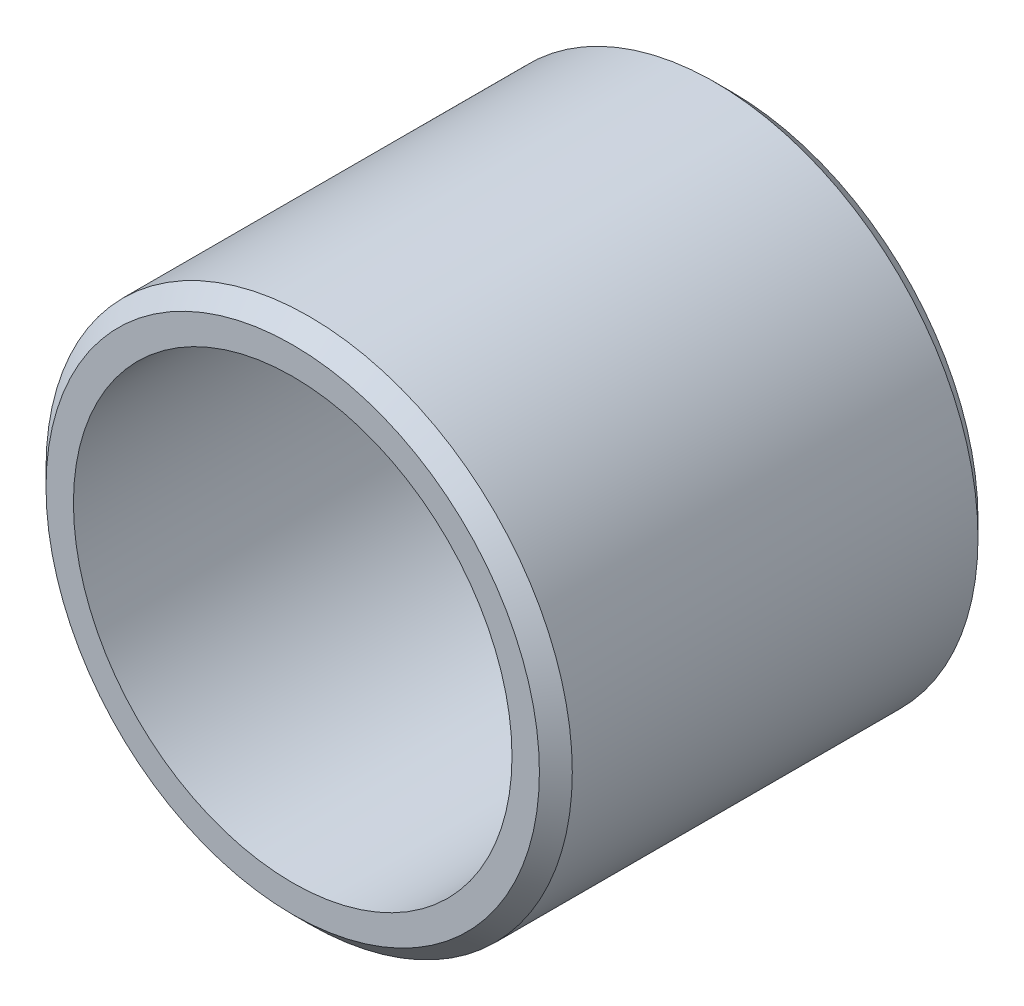
ISO-10303-21;
HEADER;
FILE_DESCRIPTION(('STEP AP214'),'2;1');
FILE_NAME('part.step','',(''),(''),'','','');
FILE_SCHEMA(('AUTOMOTIVE_DESIGN { 1 0 10303 214 1 1 1 1 }'));
ENDSEC;
DATA;
#1=APPLICATION_CONTEXT('core data for automotive mechanical design processes');
#2=APPLICATION_PROTOCOL_DEFINITION('international standard','automotive_design',2000,#1);
#3=PRODUCT_CONTEXT('',#1,'mechanical');
#4=PRODUCT('Part','Part','',(#3));
#5=PRODUCT_RELATED_PRODUCT_CATEGORY('part','',(#4));
#6=PRODUCT_DEFINITION_FORMATION('','',#4);
#7=PRODUCT_DEFINITION_CONTEXT('part definition',#1,'design');
#8=PRODUCT_DEFINITION('design','',#6,#7);
#9=PRODUCT_DEFINITION_SHAPE('','',#8);
#10=(LENGTH_UNIT() NAMED_UNIT(*) SI_UNIT(.MILLI.,.METRE.));
#11=(NAMED_UNIT(*) PLANE_ANGLE_UNIT() SI_UNIT($,.RADIAN.));
#12=(NAMED_UNIT(*) SI_UNIT($,.STERADIAN.) SOLID_ANGLE_UNIT());
#13=UNCERTAINTY_MEASURE_WITH_UNIT(LENGTH_MEASURE(1.E-05),#10,'distance_accuracy_value','');
#14=(GEOMETRIC_REPRESENTATION_CONTEXT(3) GLOBAL_UNCERTAINTY_ASSIGNED_CONTEXT((#13)) GLOBAL_UNIT_ASSIGNED_CONTEXT((#10,
#11,#12)) REPRESENTATION_CONTEXT('',''));
#15=CARTESIAN_POINT('',(0.,0.,0.));
#16=DIRECTION('',(0.,0.,1.));
#17=DIRECTION('',(1.,0.,0.));
#18=AXIS2_PLACEMENT_3D('',#15,#16,#17);
#19=CARTESIAN_POINT('',(0.,30.,25.));
#20=DIRECTION('',(0.,0.,-1.));
#21=DIRECTION('',(-1.,0.,0.));
#22=AXIS2_PLACEMENT_3D('',#19,#20,#21);
#23=PLANE('',#22);
#24=CARTESIAN_POINT('',(0.,0.,25.));
#25=DIRECTION('',(0.,0.,-1.));
#26=DIRECTION('',(-1.,0.,0.));
#27=AXIS2_PLACEMENT_3D('',#24,#25,#26);
#28=CIRCLE('',#27,28.125);
#29=CARTESIAN_POINT('',(-28.125,0.,25.));
#30=VERTEX_POINT('',#29);
#31=EDGE_CURVE('E10',#30,#30,#28,.F.);
#32=ORIENTED_EDGE('',*,*,#31,.T.);
#33=EDGE_LOOP('',(#32));
#34=FACE_BOUND('',#33,.T.);
#35=CARTESIAN_POINT('',(0.,0.,25.));
#36=DIRECTION('',(0.,0.,1.));
#37=DIRECTION('',(1.,0.,0.));
#38=AXIS2_PLACEMENT_3D('',#35,#36,#37);
#39=CIRCLE('',#38,25.);
#40=CARTESIAN_POINT('',(25.,0.,25.));
#41=VERTEX_POINT('',#40);
#42=EDGE_CURVE('E53',#41,#41,#39,.T.);
#43=ORIENTED_EDGE('',*,*,#42,.F.);
#44=EDGE_LOOP('',(#43));
#45=FACE_BOUND('',#44,.T.);
#46=ADVANCED_FACE('F33',(#34,#45),#23,.F.);
#47=CARTESIAN_POINT('',(0.,0.,25.));
#48=DIRECTION('',(0.,0.,1.));
#49=DIRECTION('',(1.,0.,0.));
#50=AXIS2_PLACEMENT_3D('',#47,#48,#49);
#51=CYLINDRICAL_SURFACE('',#50,25.);
#52=CARTESIAN_POINT('',(0.,0.,-25.));
#53=DIRECTION('',(0.,0.,1.));
#54=DIRECTION('',(1.,0.,0.));
#55=AXIS2_PLACEMENT_3D('',#52,#53,#54);
#56=CIRCLE('',#55,25.);
#57=CARTESIAN_POINT('',(25.,0.,-25.));
#58=VERTEX_POINT('',#57);
#59=EDGE_CURVE('E56',#58,#58,#56,.T.);
#60=ORIENTED_EDGE('',*,*,#59,.F.);
#61=EDGE_LOOP('',(#60));
#62=FACE_BOUND('',#61,.T.);
#63=ORIENTED_EDGE('',*,*,#42,.T.);
#64=EDGE_LOOP('',(#63));
#65=FACE_BOUND('',#64,.T.);
#66=ADVANCED_FACE('F62',(#62,#65),#51,.F.);
#67=CARTESIAN_POINT('',(0.,25.,-25.));
#68=DIRECTION('',(0.,0.,1.));
#69=DIRECTION('',(1.,0.,0.));
#70=AXIS2_PLACEMENT_3D('',#67,#68,#69);
#71=PLANE('',#70);
#72=CARTESIAN_POINT('',(0.,0.,-25.));
#73=DIRECTION('',(0.,0.,1.));
#74=DIRECTION('',(1.,0.,0.));
#75=AXIS2_PLACEMENT_3D('',#72,#73,#74);
#76=CIRCLE('',#75,28.125);
#77=CARTESIAN_POINT('',(28.125,0.,-25.));
#78=VERTEX_POINT('',#77);
#79=EDGE_CURVE('E40',#78,#78,#76,.F.);
#80=ORIENTED_EDGE('',*,*,#79,.T.);
#81=EDGE_LOOP('',(#80));
#82=FACE_BOUND('',#81,.T.);
#83=ORIENTED_EDGE('',*,*,#59,.T.);
#84=EDGE_LOOP('',(#83));
#85=FACE_BOUND('',#84,.T.);
#86=ADVANCED_FACE('F60',(#82,#85),#71,.F.);
#87=CARTESIAN_POINT('',(0.,0.,25.));
#88=DIRECTION('',(0.,0.,1.));
#89=DIRECTION('',(1.,0.,0.));
#90=AXIS2_PLACEMENT_3D('',#87,#88,#89);
#91=CYLINDRICAL_SURFACE('',#90,30.);
#92=CARTESIAN_POINT('',(0.,0.,-23.125));
#93=DIRECTION('',(0.,0.,1.));
#94=DIRECTION('',(1.,0.,0.));
#95=AXIS2_PLACEMENT_3D('',#92,#93,#94);
#96=CIRCLE('',#95,30.);
#97=CARTESIAN_POINT('',(30.,0.,-23.125));
#98=VERTEX_POINT('',#97);
#99=EDGE_CURVE('E44',#98,#98,#96,.T.);
#100=ORIENTED_EDGE('',*,*,#99,.T.);
#101=EDGE_LOOP('',(#100));
#102=FACE_BOUND('',#101,.T.);
#103=CARTESIAN_POINT('',(0.,0.,23.125));
#104=DIRECTION('',(0.,0.,-1.));
#105=DIRECTION('',(-1.,0.,0.));
#106=AXIS2_PLACEMENT_3D('',#103,#104,#105);
#107=CIRCLE('',#106,30.);
#108=CARTESIAN_POINT('',(-30.,0.,23.125));
#109=VERTEX_POINT('',#108);
#110=EDGE_CURVE('E48',#109,#109,#107,.T.);
#111=ORIENTED_EDGE('',*,*,#110,.T.);
#112=EDGE_LOOP('',(#111));
#113=FACE_BOUND('',#112,.T.);
#114=ADVANCED_FACE('F75',(#102,#113),#91,.T.);
#115=CARTESIAN_POINT('',(0.,0.,-23.125));
#116=DIRECTION('',(0.,0.,1.));
#117=DIRECTION('',(1.,0.,0.));
#118=AXIS2_PLACEMENT_3D('',#115,#116,#117);
#119=CONICAL_SURFACE('',#118,30.,0.785398163397451);
#120=ORIENTED_EDGE('',*,*,#79,.F.);
#121=EDGE_LOOP('',(#120));
#122=FACE_BOUND('',#121,.T.);
#123=ORIENTED_EDGE('',*,*,#99,.F.);
#124=EDGE_LOOP('',(#123));
#125=FACE_BOUND('',#124,.T.);
#126=ADVANCED_FACE('F73',(#122,#125),#119,.T.);
#127=CARTESIAN_POINT('',(0.,0.,25.));
#128=DIRECTION('',(0.,0.,-1.));
#129=DIRECTION('',(-1.,0.,0.));
#130=AXIS2_PLACEMENT_3D('',#127,#128,#129);
#131=CONICAL_SURFACE('',#130,28.125,0.785398163397445);
#132=ORIENTED_EDGE('',*,*,#110,.F.);
#133=EDGE_LOOP('',(#132));
#134=FACE_BOUND('',#133,.T.);
#135=ORIENTED_EDGE('',*,*,#31,.F.);
#136=EDGE_LOOP('',(#135));
#137=FACE_BOUND('',#136,.T.);
#138=ADVANCED_FACE('F35',(#134,#137),#131,.T.);
#139=CLOSED_SHELL('',(#46,#66,#86,#114,#126,#138));
#140=MANIFOLD_SOLID_BREP('B2',#139);
#141=ADVANCED_BREP_SHAPE_REPRESENTATION('',(#18,#140),#14);
#142=SHAPE_DEFINITION_REPRESENTATION(#9,#141);
ENDSEC;
END-ISO-10303-21;
